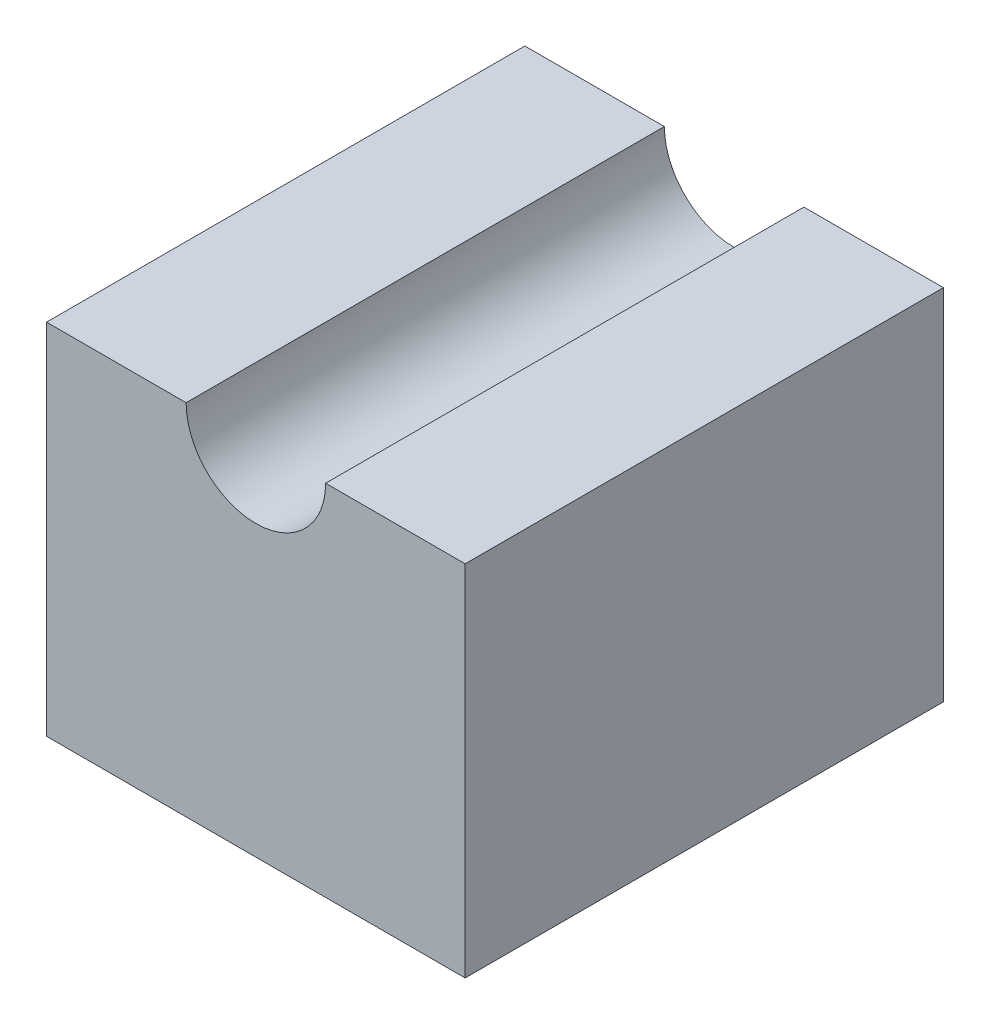
ISO-10303-21;
HEADER;
FILE_DESCRIPTION(('STEP AP214'),'2;1');
FILE_NAME('part.step','',(''),(''),'','','');
FILE_SCHEMA(('AUTOMOTIVE_DESIGN { 1 0 10303 214 1 1 1 1 }'));
ENDSEC;
DATA;
#1=APPLICATION_CONTEXT('core data for automotive mechanical design processes');
#2=APPLICATION_PROTOCOL_DEFINITION('international standard','automotive_design',2000,#1);
#3=PRODUCT_CONTEXT('',#1,'mechanical');
#4=PRODUCT('Part','Part','',(#3));
#5=PRODUCT_RELATED_PRODUCT_CATEGORY('part','',(#4));
#6=PRODUCT_DEFINITION_FORMATION('','',#4);
#7=PRODUCT_DEFINITION_CONTEXT('part definition',#1,'design');
#8=PRODUCT_DEFINITION('design','',#6,#7);
#9=PRODUCT_DEFINITION_SHAPE('','',#8);
#10=(LENGTH_UNIT() NAMED_UNIT(*) SI_UNIT(.MILLI.,.METRE.));
#11=(NAMED_UNIT(*) PLANE_ANGLE_UNIT() SI_UNIT($,.RADIAN.));
#12=(NAMED_UNIT(*) SI_UNIT($,.STERADIAN.) SOLID_ANGLE_UNIT());
#13=UNCERTAINTY_MEASURE_WITH_UNIT(LENGTH_MEASURE(1.E-05),#10,'distance_accuracy_value','');
#14=(GEOMETRIC_REPRESENTATION_CONTEXT(3) GLOBAL_UNCERTAINTY_ASSIGNED_CONTEXT((#13)) GLOBAL_UNIT_ASSIGNED_CONTEXT((#10,
#11,#12)) REPRESENTATION_CONTEXT('',''));
#15=CARTESIAN_POINT('',(0.,0.,0.));
#16=DIRECTION('',(0.,0.,1.));
#17=DIRECTION('',(1.,0.,0.));
#18=AXIS2_PLACEMENT_3D('',#15,#16,#17);
#19=CARTESIAN_POINT('',(0.,-38.1,50.8));
#20=DIRECTION('',(1.,0.,0.));
#21=DIRECTION('',(0.,0.,-1.));
#22=AXIS2_PLACEMENT_3D('',#19,#20,#21);
#23=PLANE('',#22);
#24=DIRECTION('',(0.,-1.,0.));
#25=VECTOR('',#24,1.);
#26=CARTESIAN_POINT('',(0.,-38.1,0.));
#27=LINE('',#26,#25);
#28=CARTESIAN_POINT('',(0.,0.,0.));
#29=VERTEX_POINT('',#28);
#30=CARTESIAN_POINT('',(0.,-38.1,0.));
#31=VERTEX_POINT('',#30);
#32=EDGE_CURVE('E118',#29,#31,#27,.T.);
#33=ORIENTED_EDGE('',*,*,#32,.T.);
#34=DIRECTION('',(0.,0.,-1.));
#35=VECTOR('',#34,1.);
#36=CARTESIAN_POINT('',(0.,-38.1,50.8));
#37=LINE('',#36,#35);
#38=CARTESIAN_POINT('',(0.,-38.1,50.8));
#39=VERTEX_POINT('',#38);
#40=EDGE_CURVE('E11',#39,#31,#37,.T.);
#41=ORIENTED_EDGE('',*,*,#40,.F.);
#42=DIRECTION('',(0.,-1.,0.));
#43=VECTOR('',#42,1.);
#44=CARTESIAN_POINT('',(0.,-38.1,50.8));
#45=LINE('',#44,#43);
#46=CARTESIAN_POINT('',(0.,0.,50.8));
#47=VERTEX_POINT('',#46);
#48=EDGE_CURVE('E128',#47,#39,#45,.T.);
#49=ORIENTED_EDGE('',*,*,#48,.F.);
#50=DIRECTION('',(0.,0.,-1.));
#51=VECTOR('',#50,1.);
#52=CARTESIAN_POINT('',(0.,0.,50.8));
#53=LINE('',#52,#51);
#54=EDGE_CURVE('E114',#47,#29,#53,.T.);
#55=ORIENTED_EDGE('',*,*,#54,.T.);
#56=EDGE_LOOP('',(#33,#41,#49,#55));
#57=FACE_BOUND('',#56,.T.);
#58=ADVANCED_FACE('F34',(#57),#23,.F.);
#59=CARTESIAN_POINT('',(44.46,-38.1,50.8));
#60=DIRECTION('',(0.,1.,0.));
#61=DIRECTION('',(-1.,0.,0.));
#62=AXIS2_PLACEMENT_3D('',#59,#60,#61);
#63=PLANE('',#62);
#64=DIRECTION('',(1.,0.,0.));
#65=VECTOR('',#64,1.);
#66=CARTESIAN_POINT('',(44.46,-38.1,0.));
#67=LINE('',#66,#65);
#68=CARTESIAN_POINT('',(44.46,-38.1,0.));
#69=VERTEX_POINT('',#68);
#70=EDGE_CURVE('E121',#31,#69,#67,.T.);
#71=ORIENTED_EDGE('',*,*,#70,.T.);
#72=DIRECTION('',(0.,0.,-1.));
#73=VECTOR('',#72,1.);
#74=CARTESIAN_POINT('',(44.46,-38.1,50.8));
#75=LINE('',#74,#73);
#76=CARTESIAN_POINT('',(44.46,-38.1,50.8));
#77=VERTEX_POINT('',#76);
#78=EDGE_CURVE('E42',#77,#69,#75,.T.);
#79=ORIENTED_EDGE('',*,*,#78,.F.);
#80=DIRECTION('',(1.,0.,0.));
#81=VECTOR('',#80,1.);
#82=CARTESIAN_POINT('',(44.46,-38.1,50.8));
#83=LINE('',#82,#81);
#84=EDGE_CURVE('E87',#39,#77,#83,.T.);
#85=ORIENTED_EDGE('',*,*,#84,.F.);
#86=ORIENTED_EDGE('',*,*,#40,.T.);
#87=EDGE_LOOP('',(#71,#79,#85,#86));
#88=FACE_BOUND('',#87,.T.);
#89=ADVANCED_FACE('F152',(#88),#63,.F.);
#90=CARTESIAN_POINT('',(44.46,0.,50.8));
#91=DIRECTION('',(-1.,0.,0.));
#92=DIRECTION('',(0.,-1.,0.));
#93=AXIS2_PLACEMENT_3D('',#90,#91,#92);
#94=PLANE('',#93);
#95=DIRECTION('',(0.,1.,0.));
#96=VECTOR('',#95,1.);
#97=CARTESIAN_POINT('',(44.46,0.,0.));
#98=LINE('',#97,#96);
#99=CARTESIAN_POINT('',(44.46,0.,0.));
#100=VERTEX_POINT('',#99);
#101=EDGE_CURVE('E123',#69,#100,#98,.T.);
#102=ORIENTED_EDGE('',*,*,#101,.T.);
#103=DIRECTION('',(0.,0.,-1.));
#104=VECTOR('',#103,1.);
#105=CARTESIAN_POINT('',(44.46,0.,50.8));
#106=LINE('',#105,#104);
#107=CARTESIAN_POINT('',(44.46,0.,50.8));
#108=VERTEX_POINT('',#107);
#109=EDGE_CURVE('E109',#108,#100,#106,.T.);
#110=ORIENTED_EDGE('',*,*,#109,.F.);
#111=DIRECTION('',(0.,1.,0.));
#112=VECTOR('',#111,1.);
#113=CARTESIAN_POINT('',(44.46,0.,50.8));
#114=LINE('',#113,#112);
#115=EDGE_CURVE('E100',#77,#108,#114,.T.);
#116=ORIENTED_EDGE('',*,*,#115,.F.);
#117=ORIENTED_EDGE('',*,*,#78,.T.);
#118=EDGE_LOOP('',(#102,#110,#116,#117));
#119=FACE_BOUND('',#118,.T.);
#120=ADVANCED_FACE('F134',(#119),#94,.F.);
#121=CARTESIAN_POINT('',(29.64,0.,50.8));
#122=DIRECTION('',(0.,-1.,0.));
#123=DIRECTION('',(0.,0.,-1.));
#124=AXIS2_PLACEMENT_3D('',#121,#122,#123);
#125=PLANE('',#124);
#126=DIRECTION('',(-1.,0.,0.));
#127=VECTOR('',#126,1.);
#128=CARTESIAN_POINT('',(29.64,0.,0.));
#129=LINE('',#128,#127);
#130=CARTESIAN_POINT('',(29.64,0.,0.));
#131=VERTEX_POINT('',#130);
#132=EDGE_CURVE('E108',#100,#131,#129,.T.);
#133=ORIENTED_EDGE('',*,*,#132,.T.);
#134=DIRECTION('',(0.,0.,-1.));
#135=VECTOR('',#134,1.);
#136=CARTESIAN_POINT('',(29.64,0.,50.8));
#137=LINE('',#136,#135);
#138=CARTESIAN_POINT('',(29.64,0.,50.8));
#139=VERTEX_POINT('',#138);
#140=EDGE_CURVE('E105',#139,#131,#137,.T.);
#141=ORIENTED_EDGE('',*,*,#140,.F.);
#142=DIRECTION('',(-1.,0.,0.));
#143=VECTOR('',#142,1.);
#144=CARTESIAN_POINT('',(29.64,0.,50.8));
#145=LINE('',#144,#143);
#146=EDGE_CURVE('E94',#108,#139,#145,.T.);
#147=ORIENTED_EDGE('',*,*,#146,.F.);
#148=ORIENTED_EDGE('',*,*,#109,.T.);
#149=EDGE_LOOP('',(#133,#141,#147,#148));
#150=FACE_BOUND('',#149,.T.);
#151=ADVANCED_FACE('F106',(#150),#125,.F.);
#152=CARTESIAN_POINT('',(22.23,0.,50.8));
#153=DIRECTION('',(0.,0.,-1.));
#154=DIRECTION('',(-1.,0.,0.));
#155=AXIS2_PLACEMENT_3D('',#152,#153,#154);
#156=CYLINDRICAL_SURFACE('',#155,7.41);
#157=CARTESIAN_POINT('',(22.23,0.,0.));
#158=DIRECTION('',(0.,0.,-1.));
#159=DIRECTION('',(1.,0.,0.));
#160=AXIS2_PLACEMENT_3D('',#157,#158,#159);
#161=CIRCLE('',#160,7.41);
#162=CARTESIAN_POINT('',(14.82,0.,0.));
#163=VERTEX_POINT('',#162);
#164=EDGE_CURVE('E73',#131,#163,#161,.T.);
#165=ORIENTED_EDGE('',*,*,#164,.T.);
#166=DIRECTION('',(0.,0.,-1.));
#167=VECTOR('',#166,1.);
#168=CARTESIAN_POINT('',(14.82,0.,50.8));
#169=LINE('',#168,#167);
#170=CARTESIAN_POINT('',(14.82,0.,50.8));
#171=VERTEX_POINT('',#170);
#172=EDGE_CURVE('E110',#171,#163,#169,.T.);
#173=ORIENTED_EDGE('',*,*,#172,.F.);
#174=CARTESIAN_POINT('',(22.23,0.,50.8));
#175=DIRECTION('',(0.,0.,-1.));
#176=DIRECTION('',(1.,0.,0.));
#177=AXIS2_PLACEMENT_3D('',#174,#175,#176);
#178=CIRCLE('',#177,7.41);
#179=EDGE_CURVE('E98',#139,#171,#178,.T.);
#180=ORIENTED_EDGE('',*,*,#179,.F.);
#181=ORIENTED_EDGE('',*,*,#140,.T.);
#182=EDGE_LOOP('',(#165,#173,#180,#181));
#183=FACE_BOUND('',#182,.T.);
#184=ADVANCED_FACE('F112',(#183),#156,.F.);
#185=CARTESIAN_POINT('',(0.,0.,50.8));
#186=DIRECTION('',(0.,-1.,0.));
#187=DIRECTION('',(0.,0.,-1.));
#188=AXIS2_PLACEMENT_3D('',#185,#186,#187);
#189=PLANE('',#188);
#190=DIRECTION('',(-1.,0.,0.));
#191=VECTOR('',#190,1.);
#192=CARTESIAN_POINT('',(0.,0.,0.));
#193=LINE('',#192,#191);
#194=EDGE_CURVE('E79',#163,#29,#193,.T.);
#195=ORIENTED_EDGE('',*,*,#194,.T.);
#196=ORIENTED_EDGE('',*,*,#54,.F.);
#197=DIRECTION('',(-1.,0.,0.));
#198=VECTOR('',#197,1.);
#199=CARTESIAN_POINT('',(0.,0.,50.8));
#200=LINE('',#199,#198);
#201=EDGE_CURVE('E50',#171,#47,#200,.T.);
#202=ORIENTED_EDGE('',*,*,#201,.F.);
#203=ORIENTED_EDGE('',*,*,#172,.T.);
#204=EDGE_LOOP('',(#195,#196,#202,#203));
#205=FACE_BOUND('',#204,.T.);
#206=ADVANCED_FACE('F141',(#205),#189,.F.);
#207=CARTESIAN_POINT('',(22.23,0.,50.8));
#208=DIRECTION('',(0.,0.,1.));
#209=DIRECTION('',(1.,0.,0.));
#210=AXIS2_PLACEMENT_3D('',#207,#208,#209);
#211=PLANE('',#210);
#212=ORIENTED_EDGE('',*,*,#48,.T.);
#213=ORIENTED_EDGE('',*,*,#84,.T.);
#214=ORIENTED_EDGE('',*,*,#115,.T.);
#215=ORIENTED_EDGE('',*,*,#146,.T.);
#216=ORIENTED_EDGE('',*,*,#179,.T.);
#217=ORIENTED_EDGE('',*,*,#201,.T.);
#218=EDGE_LOOP('',(#212,#213,#214,#215,#216,#217));
#219=FACE_BOUND('',#218,.T.);
#220=ADVANCED_FACE('F96',(#219),#211,.T.);
#221=CARTESIAN_POINT('',(22.23,0.,0.));
#222=DIRECTION('',(0.,0.,1.));
#223=DIRECTION('',(1.,0.,0.));
#224=AXIS2_PLACEMENT_3D('',#221,#222,#223);
#225=PLANE('',#224);
#226=ORIENTED_EDGE('',*,*,#32,.F.);
#227=ORIENTED_EDGE('',*,*,#194,.F.);
#228=ORIENTED_EDGE('',*,*,#164,.F.);
#229=ORIENTED_EDGE('',*,*,#132,.F.);
#230=ORIENTED_EDGE('',*,*,#101,.F.);
#231=ORIENTED_EDGE('',*,*,#70,.F.);
#232=EDGE_LOOP('',(#226,#227,#228,#229,#230,#231));
#233=FACE_BOUND('',#232,.T.);
#234=ADVANCED_FACE('F137',(#233),#225,.F.);
#235=CLOSED_SHELL('',(#58,#89,#120,#151,#184,#206,#220,#234));
#236=MANIFOLD_SOLID_BREP('B2',#235);
#237=ADVANCED_BREP_SHAPE_REPRESENTATION('',(#18,#236),#14);
#238=SHAPE_DEFINITION_REPRESENTATION(#9,#237);
ENDSEC;
END-ISO-10303-21;
